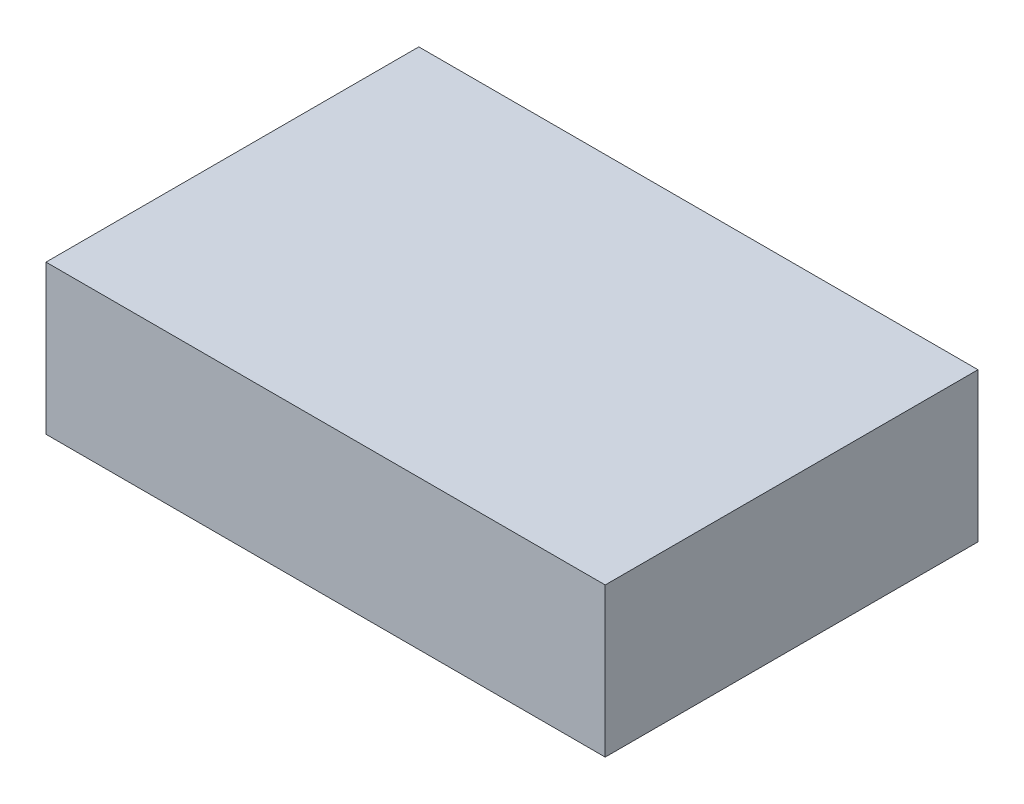
ISO-10303-21;
HEADER;
FILE_DESCRIPTION(('STEP AP214'),'2;1');
FILE_NAME('part.step','',(''),(''),'','','');
FILE_SCHEMA(('AUTOMOTIVE_DESIGN { 1 0 10303 214 1 1 1 1 }'));
ENDSEC;
DATA;
#1=APPLICATION_CONTEXT('core data for automotive mechanical design processes');
#2=APPLICATION_PROTOCOL_DEFINITION('international standard','automotive_design',2000,#1);
#3=PRODUCT_CONTEXT('',#1,'mechanical');
#4=PRODUCT('Part','Part','',(#3));
#5=PRODUCT_RELATED_PRODUCT_CATEGORY('part','',(#4));
#6=PRODUCT_DEFINITION_FORMATION('','',#4);
#7=PRODUCT_DEFINITION_CONTEXT('part definition',#1,'design');
#8=PRODUCT_DEFINITION('design','',#6,#7);
#9=PRODUCT_DEFINITION_SHAPE('','',#8);
#10=(LENGTH_UNIT() NAMED_UNIT(*) SI_UNIT(.MILLI.,.METRE.));
#11=(NAMED_UNIT(*) PLANE_ANGLE_UNIT() SI_UNIT($,.RADIAN.));
#12=(NAMED_UNIT(*) SI_UNIT($,.STERADIAN.) SOLID_ANGLE_UNIT());
#13=UNCERTAINTY_MEASURE_WITH_UNIT(LENGTH_MEASURE(1.E-05),#10,'distance_accuracy_value','');
#14=(GEOMETRIC_REPRESENTATION_CONTEXT(3) GLOBAL_UNCERTAINTY_ASSIGNED_CONTEXT((#13)) GLOBAL_UNIT_ASSIGNED_CONTEXT((#10,
#11,#12)) REPRESENTATION_CONTEXT('',''));
#15=CARTESIAN_POINT('',(0.,0.,0.));
#16=DIRECTION('',(0.,0.,1.));
#17=DIRECTION('',(1.,0.,0.));
#18=AXIS2_PLACEMENT_3D('',#15,#16,#17);
#19=CARTESIAN_POINT('',(-102.842222947496,40.,-49.492385786802));
#20=DIRECTION('',(1.,0.,0.));
#21=DIRECTION('',(0.,0.,-1.));
#22=AXIS2_PLACEMENT_3D('',#19,#20,#21);
#23=PLANE('',#22);
#24=DIRECTION('',(0.,0.,1.));
#25=VECTOR('',#24,1.);
#26=CARTESIAN_POINT('',(-102.842222947496,0.,-49.492385786802));
#27=LINE('',#26,#25);
#28=CARTESIAN_POINT('',(-102.842222947496,0.,-49.492385786802));
#29=VERTEX_POINT('',#28);
#30=CARTESIAN_POINT('',(-102.842222947496,0.,50.507614213198));
#31=VERTEX_POINT('',#30);
#32=EDGE_CURVE('E97',#29,#31,#27,.T.);
#33=ORIENTED_EDGE('',*,*,#32,.T.);
#34=DIRECTION('',(0.,-1.,0.));
#35=VECTOR('',#34,1.);
#36=CARTESIAN_POINT('',(-102.842222947496,40.,50.507614213198));
#37=LINE('',#36,#35);
#38=CARTESIAN_POINT('',(-102.842222947496,40.,50.507614213198));
#39=VERTEX_POINT('',#38);
#40=EDGE_CURVE('E11',#39,#31,#37,.T.);
#41=ORIENTED_EDGE('',*,*,#40,.F.);
#42=DIRECTION('',(0.,0.,1.));
#43=VECTOR('',#42,1.);
#44=CARTESIAN_POINT('',(-102.842222947496,40.,-49.492385786802));
#45=LINE('',#44,#43);
#46=CARTESIAN_POINT('',(-102.842222947496,40.,-49.492385786802));
#47=VERTEX_POINT('',#46);
#48=EDGE_CURVE('E83',#47,#39,#45,.T.);
#49=ORIENTED_EDGE('',*,*,#48,.F.);
#50=DIRECTION('',(0.,-1.,0.));
#51=VECTOR('',#50,1.);
#52=CARTESIAN_POINT('',(-102.842222947496,40.,-49.492385786802));
#53=LINE('',#52,#51);
#54=EDGE_CURVE('E50',#47,#29,#53,.T.);
#55=ORIENTED_EDGE('',*,*,#54,.T.);
#56=EDGE_LOOP('',(#33,#41,#49,#55));
#57=FACE_BOUND('',#56,.T.);
#58=ADVANCED_FACE('F34',(#57),#23,.F.);
#59=CARTESIAN_POINT('',(-102.842222947496,40.,50.507614213198));
#60=DIRECTION('',(0.,0.,-1.));
#61=DIRECTION('',(-1.,0.,0.));
#62=AXIS2_PLACEMENT_3D('',#59,#60,#61);
#63=PLANE('',#62);
#64=DIRECTION('',(1.,0.,0.));
#65=VECTOR('',#64,1.);
#66=CARTESIAN_POINT('',(-102.842222947496,0.,50.507614213198));
#67=LINE('',#66,#65);
#68=CARTESIAN_POINT('',(47.1577770525044,0.,50.507614213198));
#69=VERTEX_POINT('',#68);
#70=EDGE_CURVE('E88',#31,#69,#67,.T.);
#71=ORIENTED_EDGE('',*,*,#70,.T.);
#72=DIRECTION('',(0.,-1.,0.));
#73=VECTOR('',#72,1.);
#74=CARTESIAN_POINT('',(47.1577770525044,40.,50.507614213198));
#75=LINE('',#74,#73);
#76=CARTESIAN_POINT('',(47.1577770525044,40.,50.507614213198));
#77=VERTEX_POINT('',#76);
#78=EDGE_CURVE('E42',#77,#69,#75,.T.);
#79=ORIENTED_EDGE('',*,*,#78,.F.);
#80=DIRECTION('',(1.,0.,0.));
#81=VECTOR('',#80,1.);
#82=CARTESIAN_POINT('',(-102.842222947496,40.,50.507614213198));
#83=LINE('',#82,#81);
#84=EDGE_CURVE('E75',#39,#77,#83,.T.);
#85=ORIENTED_EDGE('',*,*,#84,.F.);
#86=ORIENTED_EDGE('',*,*,#40,.T.);
#87=EDGE_LOOP('',(#71,#79,#85,#86));
#88=FACE_BOUND('',#87,.T.);
#89=ADVANCED_FACE('F87',(#88),#63,.F.);
#90=CARTESIAN_POINT('',(47.1577770525044,40.,-49.492385786802));
#91=DIRECTION('',(1.,0.,0.));
#92=DIRECTION('',(0.,0.,-1.));
#93=AXIS2_PLACEMENT_3D('',#90,#91,#92);
#94=PLANE('',#93);
#95=DIRECTION('',(0.,0.,1.));
#96=VECTOR('',#95,1.);
#97=CARTESIAN_POINT('',(47.1577770525044,0.,-49.492385786802));
#98=LINE('',#97,#96);
#99=CARTESIAN_POINT('',(47.1577770525044,0.,-49.492385786802));
#100=VERTEX_POINT('',#99);
#101=EDGE_CURVE('E100',#100,#69,#98,.T.);
#102=ORIENTED_EDGE('',*,*,#101,.F.);
#103=DIRECTION('',(0.,-1.,0.));
#104=VECTOR('',#103,1.);
#105=CARTESIAN_POINT('',(47.1577770525044,40.,-49.492385786802));
#106=LINE('',#105,#104);
#107=CARTESIAN_POINT('',(47.1577770525044,40.,-49.492385786802));
#108=VERTEX_POINT('',#107);
#109=EDGE_CURVE('E64',#108,#100,#106,.T.);
#110=ORIENTED_EDGE('',*,*,#109,.F.);
#111=DIRECTION('',(0.,0.,1.));
#112=VECTOR('',#111,1.);
#113=CARTESIAN_POINT('',(47.1577770525044,40.,-49.492385786802));
#114=LINE('',#113,#112);
#115=EDGE_CURVE('E82',#108,#77,#114,.T.);
#116=ORIENTED_EDGE('',*,*,#115,.T.);
#117=ORIENTED_EDGE('',*,*,#78,.T.);
#118=EDGE_LOOP('',(#102,#110,#116,#117));
#119=FACE_BOUND('',#118,.T.);
#120=ADVANCED_FACE('F91',(#119),#94,.T.);
#121=CARTESIAN_POINT('',(-102.842222947496,40.,-49.492385786802));
#122=DIRECTION('',(0.,0.,-1.));
#123=DIRECTION('',(-1.,0.,0.));
#124=AXIS2_PLACEMENT_3D('',#121,#122,#123);
#125=PLANE('',#124);
#126=DIRECTION('',(1.,0.,0.));
#127=VECTOR('',#126,1.);
#128=CARTESIAN_POINT('',(-102.842222947496,0.,-49.492385786802));
#129=LINE('',#128,#127);
#130=EDGE_CURVE('E102',#29,#100,#129,.T.);
#131=ORIENTED_EDGE('',*,*,#130,.F.);
#132=ORIENTED_EDGE('',*,*,#54,.F.);
#133=DIRECTION('',(1.,0.,0.));
#134=VECTOR('',#133,1.);
#135=CARTESIAN_POINT('',(-102.842222947496,40.,-49.492385786802));
#136=LINE('',#135,#134);
#137=EDGE_CURVE('E92',#47,#108,#136,.T.);
#138=ORIENTED_EDGE('',*,*,#137,.T.);
#139=ORIENTED_EDGE('',*,*,#109,.T.);
#140=EDGE_LOOP('',(#131,#132,#138,#139));
#141=FACE_BOUND('',#140,.T.);
#142=ADVANCED_FACE('F108',(#141),#125,.T.);
#143=CARTESIAN_POINT('',(0.,40.,0.));
#144=DIRECTION('',(0.,1.,0.));
#145=DIRECTION('',(0.,0.,1.));
#146=AXIS2_PLACEMENT_3D('',#143,#144,#145);
#147=PLANE('',#146);
#148=ORIENTED_EDGE('',*,*,#48,.T.);
#149=ORIENTED_EDGE('',*,*,#84,.T.);
#150=ORIENTED_EDGE('',*,*,#115,.F.);
#151=ORIENTED_EDGE('',*,*,#137,.F.);
#152=EDGE_LOOP('',(#148,#149,#150,#151));
#153=FACE_BOUND('',#152,.T.);
#154=ADVANCED_FACE('F79',(#153),#147,.T.);
#155=CARTESIAN_POINT('',(0.,0.,0.));
#156=DIRECTION('',(0.,1.,0.));
#157=DIRECTION('',(0.,0.,1.));
#158=AXIS2_PLACEMENT_3D('',#155,#156,#157);
#159=PLANE('',#158);
#160=ORIENTED_EDGE('',*,*,#32,.F.);
#161=ORIENTED_EDGE('',*,*,#130,.T.);
#162=ORIENTED_EDGE('',*,*,#101,.T.);
#163=ORIENTED_EDGE('',*,*,#70,.F.);
#164=EDGE_LOOP('',(#160,#161,#162,#163));
#165=FACE_BOUND('',#164,.T.);
#166=ADVANCED_FACE('F107',(#165),#159,.F.);
#167=CLOSED_SHELL('',(#58,#89,#120,#142,#154,#166));
#168=MANIFOLD_SOLID_BREP('B2',#167);
#169=ADVANCED_BREP_SHAPE_REPRESENTATION('',(#18,#168),#14);
#170=SHAPE_DEFINITION_REPRESENTATION(#9,#169);
ENDSEC;
END-ISO-10303-21;
